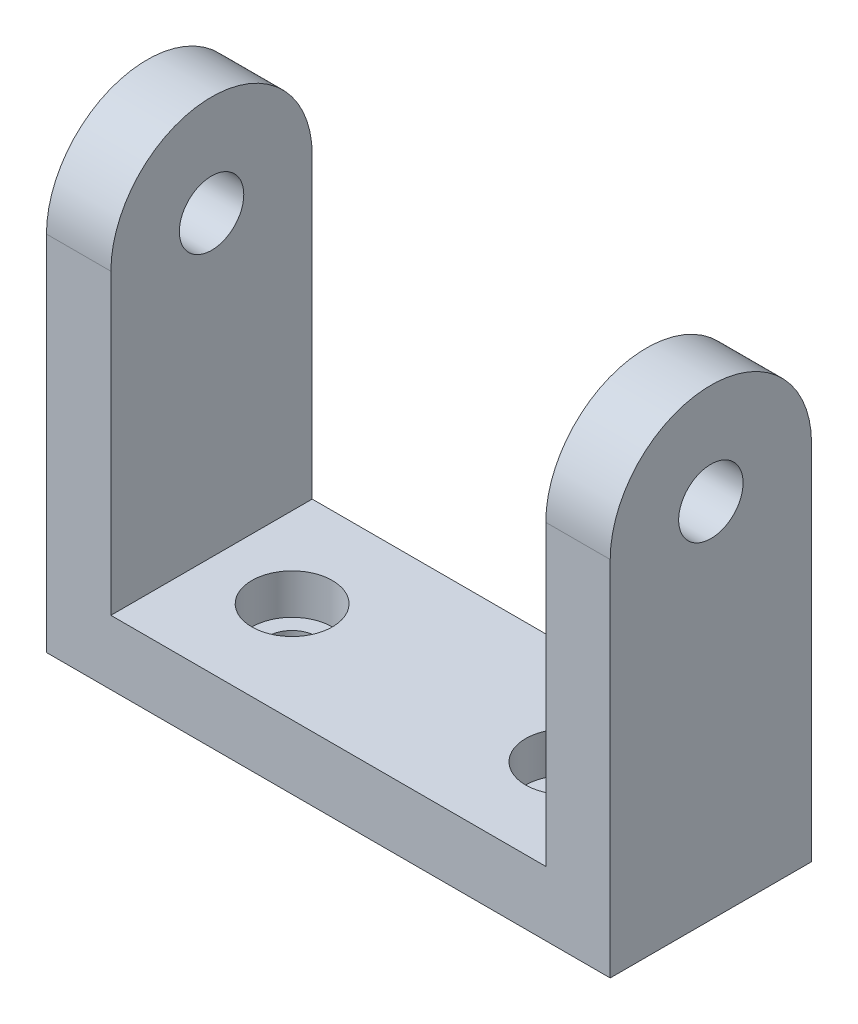
ISO-10303-21;
HEADER;
FILE_DESCRIPTION(('STEP AP214'),'2;1');
FILE_NAME('part.step','',(''),(''),'','','');
FILE_SCHEMA(('AUTOMOTIVE_DESIGN { 1 0 10303 214 1 1 1 1 }'));
ENDSEC;
DATA;
#1=APPLICATION_CONTEXT('core data for automotive mechanical design processes');
#2=APPLICATION_PROTOCOL_DEFINITION('international standard','automotive_design',2000,#1);
#3=PRODUCT_CONTEXT('',#1,'mechanical');
#4=PRODUCT('Part','Part','',(#3));
#5=PRODUCT_RELATED_PRODUCT_CATEGORY('part','',(#4));
#6=PRODUCT_DEFINITION_FORMATION('','',#4);
#7=PRODUCT_DEFINITION_CONTEXT('part definition',#1,'design');
#8=PRODUCT_DEFINITION('design','',#6,#7);
#9=PRODUCT_DEFINITION_SHAPE('','',#8);
#10=(LENGTH_UNIT() NAMED_UNIT(*) SI_UNIT(.MILLI.,.METRE.));
#11=(NAMED_UNIT(*) PLANE_ANGLE_UNIT() SI_UNIT($,.RADIAN.));
#12=(NAMED_UNIT(*) SI_UNIT($,.STERADIAN.) SOLID_ANGLE_UNIT());
#13=UNCERTAINTY_MEASURE_WITH_UNIT(LENGTH_MEASURE(1.E-05),#10,'distance_accuracy_value','');
#14=(GEOMETRIC_REPRESENTATION_CONTEXT(3) GLOBAL_UNCERTAINTY_ASSIGNED_CONTEXT((#13)) GLOBAL_UNIT_ASSIGNED_CONTEXT((#10,
#11,#12)) REPRESENTATION_CONTEXT('',''));
#15=CARTESIAN_POINT('',(0.,0.,0.));
#16=DIRECTION('',(0.,0.,1.));
#17=DIRECTION('',(1.,0.,0.));
#18=AXIS2_PLACEMENT_3D('',#15,#16,#17);
#19=CARTESIAN_POINT('',(0.,8.,0.));
#20=DIRECTION('',(0.,1.,0.));
#21=DIRECTION('',(0.,0.,1.));
#22=AXIS2_PLACEMENT_3D('',#19,#20,#21);
#23=PLANE('',#22);
#24=CARTESIAN_POINT('',(-8.95402298850576,8.,-1.83908045977011));
#25=DIRECTION('',(0.,-1.,0.));
#26=DIRECTION('',(0.,0.,1.));
#27=AXIS2_PLACEMENT_3D('',#24,#25,#26);
#28=CIRCLE('',#27,5.);
#29=CARTESIAN_POINT('',(-8.95402298850576,8.,3.16091954022989));
#30=VERTEX_POINT('',#29);
#31=EDGE_CURVE('E144',#30,#30,#28,.T.);
#32=ORIENTED_EDGE('',*,*,#31,.T.);
#33=EDGE_LOOP('',(#32));
#34=FACE_BOUND('',#33,.T.);
#35=CARTESIAN_POINT('',(25.0459770114943,8.,-1.83908045977011));
#36=DIRECTION('',(0.,1.,0.));
#37=DIRECTION('',(0.,0.,1.));
#38=AXIS2_PLACEMENT_3D('',#35,#36,#37);
#39=CIRCLE('',#38,5.);
#40=CARTESIAN_POINT('',(25.0459770114943,8.,3.16091954022989));
#41=VERTEX_POINT('',#40);
#42=EDGE_CURVE('E188',#41,#41,#39,.T.);
#43=ORIENTED_EDGE('',*,*,#42,.F.);
#44=EDGE_LOOP('',(#43));
#45=FACE_BOUND('',#44,.T.);
#46=DIRECTION('',(-1.,0.,0.));
#47=VECTOR('',#46,1.);
#48=CARTESIAN_POINT('',(-26.9540229885058,8.,-14.3390804597701));
#49=LINE('',#48,#47);
#50=CARTESIAN_POINT('',(35.0459770114943,8.,-14.3390804597701));
#51=VERTEX_POINT('',#50);
#52=CARTESIAN_POINT('',(-18.9540229885058,8.,-14.3390804597701));
#53=VERTEX_POINT('',#52);
#54=EDGE_CURVE('E64',#51,#53,#49,.T.);
#55=ORIENTED_EDGE('',*,*,#54,.T.);
#56=DIRECTION('',(0.,0.,-1.));
#57=VECTOR('',#56,1.);
#58=CARTESIAN_POINT('',(-18.9540229885058,8.,10.6609195402299));
#59=LINE('',#58,#57);
#60=CARTESIAN_POINT('',(-18.9540229885058,8.,10.6609195402299));
#61=VERTEX_POINT('',#60);
#62=EDGE_CURVE('E59',#61,#53,#59,.T.);
#63=ORIENTED_EDGE('',*,*,#62,.F.);
#64=DIRECTION('',(1.,0.,0.));
#65=VECTOR('',#64,1.);
#66=CARTESIAN_POINT('',(-26.9540229885058,8.,10.6609195402299));
#67=LINE('',#66,#65);
#68=CARTESIAN_POINT('',(35.0459770114943,8.,10.6609195402299));
#69=VERTEX_POINT('',#68);
#70=EDGE_CURVE('E133',#61,#69,#67,.T.);
#71=ORIENTED_EDGE('',*,*,#70,.T.);
#72=DIRECTION('',(0.,0.,-1.));
#73=VECTOR('',#72,1.);
#74=CARTESIAN_POINT('',(35.0459770114943,8.,10.6609195402299));
#75=LINE('',#74,#73);
#76=EDGE_CURVE('E177',#69,#51,#75,.T.);
#77=ORIENTED_EDGE('',*,*,#76,.T.);
#78=EDGE_LOOP('',(#55,#63,#71,#77));
#79=FACE_BOUND('',#78,.T.);
#80=ADVANCED_FACE('F41',(#34,#45,#79),#23,.T.);
#81=CARTESIAN_POINT('',(-8.95402298850576,0.,-1.83908045977011));
#82=DIRECTION('',(0.,1.,0.));
#83=DIRECTION('',(0.,0.,1.));
#84=AXIS2_PLACEMENT_3D('',#81,#82,#83);
#85=CYLINDRICAL_SURFACE('',#84,3.);
#86=CARTESIAN_POINT('',(-8.95402298850576,0.,-1.83908045977011));
#87=DIRECTION('',(0.,-1.,0.));
#88=DIRECTION('',(0.,0.,1.));
#89=AXIS2_PLACEMENT_3D('',#86,#87,#88);
#90=CIRCLE('',#89,3.);
#91=CARTESIAN_POINT('',(-8.95402298850576,0.,1.16091954022988));
#92=VERTEX_POINT('',#91);
#93=EDGE_CURVE('E153',#92,#92,#90,.T.);
#94=ORIENTED_EDGE('',*,*,#93,.T.);
#95=EDGE_LOOP('',(#94));
#96=FACE_BOUND('',#95,.T.);
#97=CARTESIAN_POINT('',(-8.95402298850576,3.,-1.83908045977011));
#98=DIRECTION('',(0.,1.,0.));
#99=DIRECTION('',(0.,0.,1.));
#100=AXIS2_PLACEMENT_3D('',#97,#98,#99);
#101=CIRCLE('',#100,3.);
#102=CARTESIAN_POINT('',(-8.95402298850576,3.,1.16091954022988));
#103=VERTEX_POINT('',#102);
#104=EDGE_CURVE('E45',#103,#103,#101,.T.);
#105=ORIENTED_EDGE('',*,*,#104,.T.);
#106=EDGE_LOOP('',(#105));
#107=FACE_BOUND('',#106,.T.);
#108=ADVANCED_FACE('F239',(#96,#107),#85,.F.);
#109=CARTESIAN_POINT('',(25.0459770114943,0.,-1.83908045977011));
#110=DIRECTION('',(0.,1.,0.));
#111=DIRECTION('',(0.,0.,1.));
#112=AXIS2_PLACEMENT_3D('',#109,#110,#111);
#113=CYLINDRICAL_SURFACE('',#112,3.);
#114=CARTESIAN_POINT('',(25.0459770114943,0.,-1.83908045977011));
#115=DIRECTION('',(0.,1.,0.));
#116=DIRECTION('',(0.,0.,1.));
#117=AXIS2_PLACEMENT_3D('',#114,#115,#116);
#118=CIRCLE('',#117,3.);
#119=CARTESIAN_POINT('',(25.0459770114943,0.,1.16091954022989));
#120=VERTEX_POINT('',#119);
#121=EDGE_CURVE('E200',#120,#120,#118,.T.);
#122=ORIENTED_EDGE('',*,*,#121,.F.);
#123=EDGE_LOOP('',(#122));
#124=FACE_BOUND('',#123,.T.);
#125=CARTESIAN_POINT('',(25.0459770114943,3.,-1.83908045977011));
#126=DIRECTION('',(0.,1.,0.));
#127=DIRECTION('',(0.,0.,1.));
#128=AXIS2_PLACEMENT_3D('',#125,#126,#127);
#129=CIRCLE('',#128,3.);
#130=CARTESIAN_POINT('',(25.0459770114943,3.,1.16091954022989));
#131=VERTEX_POINT('',#130);
#132=EDGE_CURVE('E196',#131,#131,#129,.F.);
#133=ORIENTED_EDGE('',*,*,#132,.F.);
#134=EDGE_LOOP('',(#133));
#135=FACE_BOUND('',#134,.T.);
#136=ADVANCED_FACE('F237',(#124,#135),#113,.F.);
#137=CARTESIAN_POINT('',(-26.9540229885058,8.,-14.3390804597701));
#138=DIRECTION('',(1.,0.,0.));
#139=DIRECTION('',(0.,0.,-1.));
#140=AXIS2_PLACEMENT_3D('',#137,#138,#139);
#141=PLANE('',#140);
#142=DIRECTION('',(0.,0.,1.));
#143=VECTOR('',#142,1.);
#144=CARTESIAN_POINT('',(-26.9540229885058,0.,-14.3390804597701));
#145=LINE('',#144,#143);
#146=CARTESIAN_POINT('',(-26.9540229885058,0.,-14.3390804597701));
#147=VERTEX_POINT('',#146);
#148=CARTESIAN_POINT('',(-26.9540229885058,0.,10.6609195402299));
#149=VERTEX_POINT('',#148);
#150=EDGE_CURVE('E204',#147,#149,#145,.T.);
#151=ORIENTED_EDGE('',*,*,#150,.T.);
#152=DIRECTION('',(0.,-1.,0.));
#153=VECTOR('',#152,1.);
#154=CARTESIAN_POINT('',(-26.9540229885058,8.,10.6609195402299));
#155=LINE('',#154,#153);
#156=CARTESIAN_POINT('',(-26.9540229885058,45.,10.6609195402299));
#157=VERTEX_POINT('',#156);
#158=EDGE_CURVE('E11',#157,#149,#155,.T.);
#159=ORIENTED_EDGE('',*,*,#158,.F.);
#160=CARTESIAN_POINT('',(-26.9540229885058,45.,-1.83908045977012));
#161=DIRECTION('',(1.,0.,0.));
#162=DIRECTION('',(0.,0.,-1.));
#163=AXIS2_PLACEMENT_3D('',#160,#161,#162);
#164=CIRCLE('',#163,12.5);
#165=CARTESIAN_POINT('',(-26.9540229885058,45.,-14.3390804597701));
#166=VERTEX_POINT('',#165);
#167=EDGE_CURVE('E126',#166,#157,#164,.T.);
#168=ORIENTED_EDGE('',*,*,#167,.F.);
#169=DIRECTION('',(0.,-1.,0.));
#170=VECTOR('',#169,1.);
#171=CARTESIAN_POINT('',(-26.9540229885058,8.,-14.3390804597701));
#172=LINE('',#171,#170);
#173=EDGE_CURVE('E210',#166,#147,#172,.T.);
#174=ORIENTED_EDGE('',*,*,#173,.T.);
#175=EDGE_LOOP('',(#151,#159,#168,#174));
#176=FACE_BOUND('',#175,.T.);
#177=CARTESIAN_POINT('',(-26.9540229885058,45.,-1.83908045977012));
#178=DIRECTION('',(1.,0.,0.));
#179=DIRECTION('',(0.,0.,-1.));
#180=AXIS2_PLACEMENT_3D('',#177,#178,#179);
#181=CIRCLE('',#180,4.);
#182=CARTESIAN_POINT('',(-26.9540229885058,45.,-5.83908045977012));
#183=VERTEX_POINT('',#182);
#184=EDGE_CURVE('E431',#183,#183,#181,.T.);
#185=ORIENTED_EDGE('',*,*,#184,.T.);
#186=EDGE_LOOP('',(#185));
#187=FACE_BOUND('',#186,.T.);
#188=ADVANCED_FACE('F43',(#176,#187),#141,.F.);
#189=CARTESIAN_POINT('',(-26.9540229885058,8.,10.6609195402299));
#190=DIRECTION('',(0.,0.,-1.));
#191=DIRECTION('',(-1.,0.,0.));
#192=AXIS2_PLACEMENT_3D('',#189,#190,#191);
#193=PLANE('',#192);
#194=DIRECTION('',(1.,0.,0.));
#195=VECTOR('',#194,1.);
#196=CARTESIAN_POINT('',(-26.9540229885058,0.,10.6609195402299));
#197=LINE('',#196,#195);
#198=CARTESIAN_POINT('',(43.0459770114943,0.,10.6609195402299));
#199=VERTEX_POINT('',#198);
#200=EDGE_CURVE('E214',#149,#199,#197,.T.);
#201=ORIENTED_EDGE('',*,*,#200,.T.);
#202=DIRECTION('',(0.,-1.,0.));
#203=VECTOR('',#202,1.);
#204=CARTESIAN_POINT('',(43.0459770114943,8.,10.6609195402299));
#205=LINE('',#204,#203);
#206=CARTESIAN_POINT('',(43.0459770114943,45.,10.6609195402299));
#207=VERTEX_POINT('',#206);
#208=EDGE_CURVE('E51',#207,#199,#205,.T.);
#209=ORIENTED_EDGE('',*,*,#208,.F.);
#210=DIRECTION('',(1.,0.,0.));
#211=VECTOR('',#210,1.);
#212=CARTESIAN_POINT('',(35.0459770114943,45.,10.6609195402299));
#213=LINE('',#212,#211);
#214=CARTESIAN_POINT('',(35.0459770114943,45.,10.6609195402299));
#215=VERTEX_POINT('',#214);
#216=EDGE_CURVE('E184',#215,#207,#213,.T.);
#217=ORIENTED_EDGE('',*,*,#216,.F.);
#218=DIRECTION('',(0.,-1.,0.));
#219=VECTOR('',#218,1.);
#220=CARTESIAN_POINT('',(35.0459770114943,45.,10.6609195402299));
#221=LINE('',#220,#219);
#222=EDGE_CURVE('E174',#215,#69,#221,.T.);
#223=ORIENTED_EDGE('',*,*,#222,.T.);
#224=ORIENTED_EDGE('',*,*,#70,.F.);
#225=DIRECTION('',(0.,-1.,0.));
#226=VECTOR('',#225,1.);
#227=CARTESIAN_POINT('',(-18.9540229885058,45.,10.6609195402299));
#228=LINE('',#227,#226);
#229=CARTESIAN_POINT('',(-18.9540229885058,45.,10.6609195402299));
#230=VERTEX_POINT('',#229);
#231=EDGE_CURVE('E113',#230,#61,#228,.T.);
#232=ORIENTED_EDGE('',*,*,#231,.F.);
#233=DIRECTION('',(-1.,0.,0.));
#234=VECTOR('',#233,1.);
#235=CARTESIAN_POINT('',(-18.9540229885058,45.,10.6609195402299));
#236=LINE('',#235,#234);
#237=EDGE_CURVE('E120',#230,#157,#236,.T.);
#238=ORIENTED_EDGE('',*,*,#237,.T.);
#239=ORIENTED_EDGE('',*,*,#158,.T.);
#240=EDGE_LOOP('',(#201,#209,#217,#223,#224,#232,#238,#239));
#241=FACE_BOUND('',#240,.T.);
#242=ADVANCED_FACE('F131',(#241),#193,.F.);
#243=CARTESIAN_POINT('',(43.0459770114943,8.,-14.3390804597701));
#244=DIRECTION('',(-1.,0.,0.));
#245=DIRECTION('',(0.,0.,1.));
#246=AXIS2_PLACEMENT_3D('',#243,#244,#245);
#247=PLANE('',#246);
#248=DIRECTION('',(0.,0.,-1.));
#249=VECTOR('',#248,1.);
#250=CARTESIAN_POINT('',(43.0459770114943,0.,-14.3390804597701));
#251=LINE('',#250,#249);
#252=CARTESIAN_POINT('',(43.0459770114943,0.,-14.3390804597701));
#253=VERTEX_POINT('',#252);
#254=EDGE_CURVE('E217',#199,#253,#251,.T.);
#255=ORIENTED_EDGE('',*,*,#254,.T.);
#256=DIRECTION('',(0.,-1.,0.));
#257=VECTOR('',#256,1.);
#258=CARTESIAN_POINT('',(43.0459770114943,8.,-14.3390804597701));
#259=LINE('',#258,#257);
#260=CARTESIAN_POINT('',(43.0459770114943,45.,-14.3390804597701));
#261=VERTEX_POINT('',#260);
#262=EDGE_CURVE('E225',#261,#253,#259,.T.);
#263=ORIENTED_EDGE('',*,*,#262,.F.);
#264=CARTESIAN_POINT('',(43.0459770114943,45.,-1.83908045977011));
#265=DIRECTION('',(1.,0.,0.));
#266=DIRECTION('',(0.,0.,-1.));
#267=AXIS2_PLACEMENT_3D('',#264,#265,#266);
#268=CIRCLE('',#267,12.5);
#269=EDGE_CURVE('E162',#261,#207,#268,.T.);
#270=ORIENTED_EDGE('',*,*,#269,.T.);
#271=ORIENTED_EDGE('',*,*,#208,.T.);
#272=EDGE_LOOP('',(#255,#263,#270,#271));
#273=FACE_BOUND('',#272,.T.);
#274=CARTESIAN_POINT('',(43.0459770114943,45.,-1.83908045977011));
#275=DIRECTION('',(1.,0.,0.));
#276=DIRECTION('',(0.,0.,-1.));
#277=AXIS2_PLACEMENT_3D('',#274,#275,#276);
#278=CIRCLE('',#277,4.);
#279=CARTESIAN_POINT('',(43.0459770114943,45.,-5.83908045977011));
#280=VERTEX_POINT('',#279);
#281=EDGE_CURVE('E157',#280,#280,#278,.T.);
#282=ORIENTED_EDGE('',*,*,#281,.F.);
#283=EDGE_LOOP('',(#282));
#284=FACE_BOUND('',#283,.T.);
#285=ADVANCED_FACE('F265',(#273,#284),#247,.F.);
#286=CARTESIAN_POINT('',(-26.9540229885058,8.,-14.3390804597701));
#287=DIRECTION('',(0.,0.,1.));
#288=DIRECTION('',(1.,0.,0.));
#289=AXIS2_PLACEMENT_3D('',#286,#287,#288);
#290=PLANE('',#289);
#291=DIRECTION('',(-1.,0.,0.));
#292=VECTOR('',#291,1.);
#293=CARTESIAN_POINT('',(-26.9540229885058,0.,-14.3390804597701));
#294=LINE('',#293,#292);
#295=EDGE_CURVE('E207',#253,#147,#294,.T.);
#296=ORIENTED_EDGE('',*,*,#295,.T.);
#297=ORIENTED_EDGE('',*,*,#173,.F.);
#298=DIRECTION('',(-1.,0.,0.));
#299=VECTOR('',#298,1.);
#300=CARTESIAN_POINT('',(-18.9540229885058,45.,-14.3390804597701));
#301=LINE('',#300,#299);
#302=CARTESIAN_POINT('',(-18.9540229885058,45.,-14.3390804597701));
#303=VERTEX_POINT('',#302);
#304=EDGE_CURVE('E129',#303,#166,#301,.T.);
#305=ORIENTED_EDGE('',*,*,#304,.F.);
#306=DIRECTION('',(0.,1.,0.));
#307=VECTOR('',#306,1.);
#308=CARTESIAN_POINT('',(-18.9540229885058,8.,-14.3390804597701));
#309=LINE('',#308,#307);
#310=EDGE_CURVE('E115',#53,#303,#309,.T.);
#311=ORIENTED_EDGE('',*,*,#310,.F.);
#312=ORIENTED_EDGE('',*,*,#54,.F.);
#313=DIRECTION('',(0.,1.,0.));
#314=VECTOR('',#313,1.);
#315=CARTESIAN_POINT('',(35.0459770114943,8.,-14.3390804597701));
#316=LINE('',#315,#314);
#317=CARTESIAN_POINT('',(35.0459770114943,45.,-14.3390804597701));
#318=VERTEX_POINT('',#317);
#319=EDGE_CURVE('E166',#51,#318,#316,.T.);
#320=ORIENTED_EDGE('',*,*,#319,.T.);
#321=DIRECTION('',(1.,0.,0.));
#322=VECTOR('',#321,1.);
#323=CARTESIAN_POINT('',(35.0459770114943,45.,-14.3390804597701));
#324=LINE('',#323,#322);
#325=EDGE_CURVE('E180',#318,#261,#324,.T.);
#326=ORIENTED_EDGE('',*,*,#325,.T.);
#327=ORIENTED_EDGE('',*,*,#262,.T.);
#328=EDGE_LOOP('',(#296,#297,#305,#311,#312,#320,#326,#327));
#329=FACE_BOUND('',#328,.T.);
#330=ADVANCED_FACE('F261',(#329),#290,.F.);
#331=CARTESIAN_POINT('',(0.,0.,0.));
#332=DIRECTION('',(0.,1.,0.));
#333=DIRECTION('',(0.,0.,1.));
#334=AXIS2_PLACEMENT_3D('',#331,#332,#333);
#335=PLANE('',#334);
#336=ORIENTED_EDGE('',*,*,#93,.F.);
#337=EDGE_LOOP('',(#336));
#338=FACE_BOUND('',#337,.T.);
#339=ORIENTED_EDGE('',*,*,#121,.T.);
#340=EDGE_LOOP('',(#339));
#341=FACE_BOUND('',#340,.T.);
#342=ORIENTED_EDGE('',*,*,#150,.F.);
#343=ORIENTED_EDGE('',*,*,#295,.F.);
#344=ORIENTED_EDGE('',*,*,#254,.F.);
#345=ORIENTED_EDGE('',*,*,#200,.F.);
#346=EDGE_LOOP('',(#342,#343,#344,#345));
#347=FACE_BOUND('',#346,.T.);
#348=ADVANCED_FACE('F258',(#338,#341,#347),#335,.F.);
#349=CARTESIAN_POINT('',(25.0459770114943,3.,-1.83908045977011));
#350=DIRECTION('',(0.,1.,0.));
#351=DIRECTION('',(0.,0.,1.));
#352=AXIS2_PLACEMENT_3D('',#349,#350,#351);
#353=PLANE('',#352);
#354=CARTESIAN_POINT('',(25.0459770114943,3.,-1.83908045977011));
#355=DIRECTION('',(0.,1.,0.));
#356=DIRECTION('',(0.,0.,1.));
#357=AXIS2_PLACEMENT_3D('',#354,#355,#356);
#358=CIRCLE('',#357,5.);
#359=CARTESIAN_POINT('',(25.0459770114943,3.,3.16091954022989));
#360=VERTEX_POINT('',#359);
#361=EDGE_CURVE('E192',#360,#360,#358,.T.);
#362=ORIENTED_EDGE('',*,*,#361,.T.);
#363=EDGE_LOOP('',(#362));
#364=FACE_BOUND('',#363,.T.);
#365=ORIENTED_EDGE('',*,*,#132,.T.);
#366=EDGE_LOOP('',(#365));
#367=FACE_BOUND('',#366,.T.);
#368=ADVANCED_FACE('F235',(#364,#367),#353,.T.);
#369=CARTESIAN_POINT('',(25.0459770114943,3.,-1.83908045977011));
#370=DIRECTION('',(0.,1.,0.));
#371=DIRECTION('',(0.,0.,1.));
#372=AXIS2_PLACEMENT_3D('',#369,#370,#371);
#373=CYLINDRICAL_SURFACE('',#372,5.);
#374=ORIENTED_EDGE('',*,*,#361,.F.);
#375=EDGE_LOOP('',(#374));
#376=FACE_BOUND('',#375,.T.);
#377=ORIENTED_EDGE('',*,*,#42,.T.);
#378=EDGE_LOOP('',(#377));
#379=FACE_BOUND('',#378,.T.);
#380=ADVANCED_FACE('F295',(#376,#379),#373,.F.);
#381=CARTESIAN_POINT('',(35.0459770114943,45.,-1.83908045977011));
#382=DIRECTION('',(1.,0.,0.));
#383=DIRECTION('',(0.,0.,-1.));
#384=AXIS2_PLACEMENT_3D('',#381,#382,#383);
#385=CYLINDRICAL_SURFACE('',#384,12.5);
#386=ORIENTED_EDGE('',*,*,#269,.F.);
#387=ORIENTED_EDGE('',*,*,#325,.F.);
#388=CARTESIAN_POINT('',(35.0459770114943,45.,-1.83908045977011));
#389=DIRECTION('',(1.,0.,0.));
#390=DIRECTION('',(0.,0.,-1.));
#391=AXIS2_PLACEMENT_3D('',#388,#389,#390);
#392=CIRCLE('',#391,12.5);
#393=EDGE_CURVE('E170',#318,#215,#392,.T.);
#394=ORIENTED_EDGE('',*,*,#393,.T.);
#395=ORIENTED_EDGE('',*,*,#216,.T.);
#396=EDGE_LOOP('',(#386,#387,#394,#395));
#397=FACE_BOUND('',#396,.T.);
#398=ADVANCED_FACE('F302',(#397),#385,.T.);
#399=CARTESIAN_POINT('',(35.0459770114943,45.,-1.83908045977011));
#400=DIRECTION('',(1.,0.,0.));
#401=DIRECTION('',(0.,0.,-1.));
#402=AXIS2_PLACEMENT_3D('',#399,#400,#401);
#403=PLANE('',#402);
#404=CARTESIAN_POINT('',(35.0459770114943,45.,-1.83908045977011));
#405=DIRECTION('',(1.,0.,0.));
#406=DIRECTION('',(0.,0.,-1.));
#407=AXIS2_PLACEMENT_3D('',#404,#405,#406);
#408=CIRCLE('',#407,4.);
#409=CARTESIAN_POINT('',(35.0459770114943,45.,-5.83908045977011));
#410=VERTEX_POINT('',#409);
#411=EDGE_CURVE('E158',#410,#410,#408,.T.);
#412=ORIENTED_EDGE('',*,*,#411,.T.);
#413=EDGE_LOOP('',(#412));
#414=FACE_BOUND('',#413,.T.);
#415=ORIENTED_EDGE('',*,*,#319,.F.);
#416=ORIENTED_EDGE('',*,*,#76,.F.);
#417=ORIENTED_EDGE('',*,*,#222,.F.);
#418=ORIENTED_EDGE('',*,*,#393,.F.);
#419=EDGE_LOOP('',(#415,#416,#417,#418));
#420=FACE_BOUND('',#419,.T.);
#421=ADVANCED_FACE('F308',(#414,#420),#403,.F.);
#422=CARTESIAN_POINT('',(35.0459770114943,45.,-1.83908045977011));
#423=DIRECTION('',(1.,0.,0.));
#424=DIRECTION('',(0.,0.,-1.));
#425=AXIS2_PLACEMENT_3D('',#422,#423,#424);
#426=CYLINDRICAL_SURFACE('',#425,4.);
#427=ORIENTED_EDGE('',*,*,#411,.F.);
#428=EDGE_LOOP('',(#427));
#429=FACE_BOUND('',#428,.T.);
#430=ORIENTED_EDGE('',*,*,#281,.T.);
#431=EDGE_LOOP('',(#430));
#432=FACE_BOUND('',#431,.T.);
#433=ADVANCED_FACE('F316',(#429,#432),#426,.F.);
#434=CARTESIAN_POINT('',(-8.95402298850576,3.,-1.83908045977011));
#435=DIRECTION('',(0.,1.,0.));
#436=DIRECTION('',(0.,0.,1.));
#437=AXIS2_PLACEMENT_3D('',#434,#435,#436);
#438=CYLINDRICAL_SURFACE('',#437,5.);
#439=CARTESIAN_POINT('',(-8.95402298850576,3.,-1.83908045977011));
#440=DIRECTION('',(0.,-1.,0.));
#441=DIRECTION('',(0.,0.,1.));
#442=AXIS2_PLACEMENT_3D('',#439,#440,#441);
#443=CIRCLE('',#442,5.);
#444=CARTESIAN_POINT('',(-8.95402298850576,3.,3.16091954022989));
#445=VERTEX_POINT('',#444);
#446=EDGE_CURVE('E146',#445,#445,#443,.T.);
#447=ORIENTED_EDGE('',*,*,#446,.T.);
#448=EDGE_LOOP('',(#447));
#449=FACE_BOUND('',#448,.T.);
#450=ORIENTED_EDGE('',*,*,#31,.F.);
#451=EDGE_LOOP('',(#450));
#452=FACE_BOUND('',#451,.T.);
#453=ADVANCED_FACE('F324',(#449,#452),#438,.F.);
#454=CARTESIAN_POINT('',(-8.95402298850576,3.,-1.83908045977011));
#455=DIRECTION('',(0.,1.,0.));
#456=DIRECTION('',(0.,0.,1.));
#457=AXIS2_PLACEMENT_3D('',#454,#455,#456);
#458=PLANE('',#457);
#459=ORIENTED_EDGE('',*,*,#104,.F.);
#460=EDGE_LOOP('',(#459));
#461=FACE_BOUND('',#460,.T.);
#462=ORIENTED_EDGE('',*,*,#446,.F.);
#463=EDGE_LOOP('',(#462));
#464=FACE_BOUND('',#463,.T.);
#465=ADVANCED_FACE('F331',(#461,#464),#458,.T.);
#466=CARTESIAN_POINT('',(-18.9540229885058,45.,-1.83908045977011));
#467=DIRECTION('',(-1.,0.,0.));
#468=DIRECTION('',(0.,0.,-1.));
#469=AXIS2_PLACEMENT_3D('',#466,#467,#468);
#470=PLANE('',#469);
#471=ORIENTED_EDGE('',*,*,#310,.T.);
#472=CARTESIAN_POINT('',(-18.9540229885058,45.,-1.83908045977011));
#473=DIRECTION('',(1.,0.,0.));
#474=DIRECTION('',(0.,0.,-1.));
#475=AXIS2_PLACEMENT_3D('',#472,#473,#474);
#476=CIRCLE('',#475,12.5);
#477=EDGE_CURVE('E108',#303,#230,#476,.T.);
#478=ORIENTED_EDGE('',*,*,#477,.T.);
#479=ORIENTED_EDGE('',*,*,#231,.T.);
#480=ORIENTED_EDGE('',*,*,#62,.T.);
#481=EDGE_LOOP('',(#471,#478,#479,#480));
#482=FACE_BOUND('',#481,.T.);
#483=CARTESIAN_POINT('',(-18.9540229885058,45.,-1.83908045977011));
#484=DIRECTION('',(1.,0.,0.));
#485=DIRECTION('',(0.,0.,-1.));
#486=AXIS2_PLACEMENT_3D('',#483,#484,#485);
#487=CIRCLE('',#486,4.);
#488=CARTESIAN_POINT('',(-18.9540229885058,45.,-5.83908045977012));
#489=VERTEX_POINT('',#488);
#490=EDGE_CURVE('E142',#489,#489,#487,.T.);
#491=ORIENTED_EDGE('',*,*,#490,.F.);
#492=EDGE_LOOP('',(#491));
#493=FACE_BOUND('',#492,.T.);
#494=ADVANCED_FACE('F110',(#482,#493),#470,.F.);
#495=CARTESIAN_POINT('',(-18.9540229885058,45.,-1.83908045977011));
#496=DIRECTION('',(-1.,0.,0.));
#497=DIRECTION('',(0.,0.,1.));
#498=AXIS2_PLACEMENT_3D('',#495,#496,#497);
#499=CYLINDRICAL_SURFACE('',#498,12.5);
#500=ORIENTED_EDGE('',*,*,#167,.T.);
#501=ORIENTED_EDGE('',*,*,#237,.F.);
#502=ORIENTED_EDGE('',*,*,#477,.F.);
#503=ORIENTED_EDGE('',*,*,#304,.T.);
#504=EDGE_LOOP('',(#500,#501,#502,#503));
#505=FACE_BOUND('',#504,.T.);
#506=ADVANCED_FACE('F124',(#505),#499,.T.);
#507=CARTESIAN_POINT('',(-18.9540229885058,45.,-1.83908045977011));
#508=DIRECTION('',(-1.,0.,0.));
#509=DIRECTION('',(0.,0.,1.));
#510=AXIS2_PLACEMENT_3D('',#507,#508,#509);
#511=CYLINDRICAL_SURFACE('',#510,4.);
#512=ORIENTED_EDGE('',*,*,#490,.T.);
#513=EDGE_LOOP('',(#512));
#514=FACE_BOUND('',#513,.T.);
#515=ORIENTED_EDGE('',*,*,#184,.F.);
#516=EDGE_LOOP('',(#515));
#517=FACE_BOUND('',#516,.T.);
#518=ADVANCED_FACE('F352',(#514,#517),#511,.F.);
#519=CLOSED_SHELL('',(#80,#108,#136,#188,#242,#285,#330,#348,#368,#380,#398,#421,#433,#453,#465,
#494,#506,#518));
#520=MANIFOLD_SOLID_BREP('B2',#519);
#521=ADVANCED_BREP_SHAPE_REPRESENTATION('',(#18,#520),#14);
#522=SHAPE_DEFINITION_REPRESENTATION(#9,#521);
ENDSEC;
END-ISO-10303-21;
